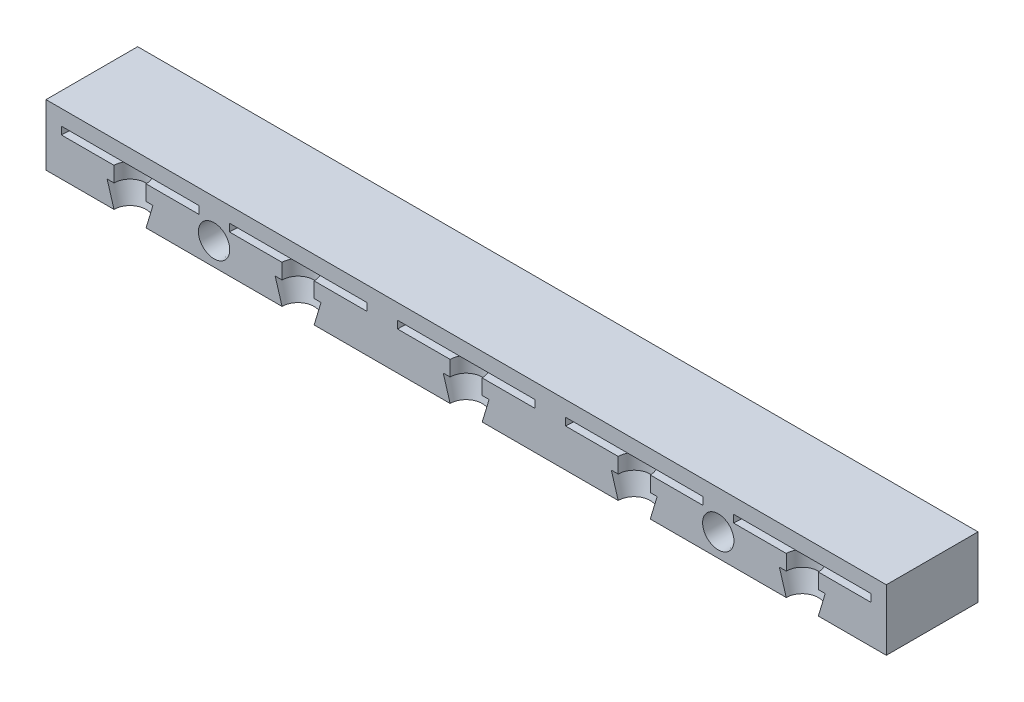
ISO-10303-21;
HEADER;
FILE_DESCRIPTION(('STEP AP214'),'2;1');
FILE_NAME('part.step','',(''),(''),'','','');
FILE_SCHEMA(('AUTOMOTIVE_DESIGN { 1 0 10303 214 1 1 1 1 }'));
ENDSEC;
DATA;
#1=APPLICATION_CONTEXT('core data for automotive mechanical design processes');
#2=APPLICATION_PROTOCOL_DEFINITION('international standard','automotive_design',2000,#1);
#3=PRODUCT_CONTEXT('',#1,'mechanical');
#4=PRODUCT('Part','Part','',(#3));
#5=PRODUCT_RELATED_PRODUCT_CATEGORY('part','',(#4));
#6=PRODUCT_DEFINITION_FORMATION('','',#4);
#7=PRODUCT_DEFINITION_CONTEXT('part definition',#1,'design');
#8=PRODUCT_DEFINITION('design','',#6,#7);
#9=PRODUCT_DEFINITION_SHAPE('','',#8);
#10=(LENGTH_UNIT() NAMED_UNIT(*) SI_UNIT(.MILLI.,.METRE.));
#11=(NAMED_UNIT(*) PLANE_ANGLE_UNIT() SI_UNIT($,.RADIAN.));
#12=(NAMED_UNIT(*) SI_UNIT($,.STERADIAN.) SOLID_ANGLE_UNIT());
#13=UNCERTAINTY_MEASURE_WITH_UNIT(LENGTH_MEASURE(1.E-05),#10,'distance_accuracy_value','');
#14=(GEOMETRIC_REPRESENTATION_CONTEXT(3) GLOBAL_UNCERTAINTY_ASSIGNED_CONTEXT((#13)) GLOBAL_UNIT_ASSIGNED_CONTEXT((#10,
#11,#12)) REPRESENTATION_CONTEXT('',''));
#15=CARTESIAN_POINT('',(0.,0.,0.));
#16=DIRECTION('',(0.,0.,1.));
#17=DIRECTION('',(1.,0.,0.));
#18=AXIS2_PLACEMENT_3D('',#15,#16,#17);
#19=CARTESIAN_POINT('',(0.,0.,-12.));
#20=DIRECTION('',(-1.,0.,0.));
#21=DIRECTION('',(0.,0.,1.));
#22=AXIS2_PLACEMENT_3D('',#19,#20,#21);
#23=PLANE('',#22);
#24=DIRECTION('',(0.,-1.,0.));
#25=VECTOR('',#24,1.);
#26=CARTESIAN_POINT('',(0.,0.,0.));
#27=LINE('',#26,#25);
#28=CARTESIAN_POINT('',(0.,8.,0.));
#29=VERTEX_POINT('',#28);
#30=CARTESIAN_POINT('',(0.,0.,0.));
#31=VERTEX_POINT('',#30);
#32=EDGE_CURVE('E376',#29,#31,#27,.T.);
#33=ORIENTED_EDGE('',*,*,#32,.F.);
#34=DIRECTION('',(0.,0.,1.));
#35=VECTOR('',#34,1.);
#36=CARTESIAN_POINT('',(0.,8.,-12.));
#37=LINE('',#36,#35);
#38=CARTESIAN_POINT('',(0.,8.,-12.));
#39=VERTEX_POINT('',#38);
#40=EDGE_CURVE('E403',#39,#29,#37,.T.);
#41=ORIENTED_EDGE('',*,*,#40,.F.);
#42=DIRECTION('',(0.,-1.,0.));
#43=VECTOR('',#42,1.);
#44=CARTESIAN_POINT('',(0.,0.,-12.));
#45=LINE('',#44,#43);
#46=CARTESIAN_POINT('',(0.,0.,-12.));
#47=VERTEX_POINT('',#46);
#48=EDGE_CURVE('E377',#39,#47,#45,.T.);
#49=ORIENTED_EDGE('',*,*,#48,.T.);
#50=DIRECTION('',(0.,0.,1.));
#51=VECTOR('',#50,1.);
#52=CARTESIAN_POINT('',(0.,0.,-12.));
#53=LINE('',#52,#51);
#54=EDGE_CURVE('E390',#47,#31,#53,.T.);
#55=ORIENTED_EDGE('',*,*,#54,.T.);
#56=EDGE_LOOP('',(#33,#41,#49,#55));
#57=FACE_BOUND('',#56,.T.);
#58=ADVANCED_FACE('F33',(#57),#23,.T.);
#59=CARTESIAN_POINT('',(0.,8.,-12.));
#60=DIRECTION('',(0.,1.,0.));
#61=DIRECTION('',(0.,0.,1.));
#62=AXIS2_PLACEMENT_3D('',#59,#60,#61);
#63=PLANE('',#62);
#64=DIRECTION('',(-1.,0.,0.));
#65=VECTOR('',#64,1.);
#66=CARTESIAN_POINT('',(0.,8.,0.));
#67=LINE('',#66,#65);
#68=CARTESIAN_POINT('',(110.,8.,0.));
#69=VERTEX_POINT('',#68);
#70=EDGE_CURVE('E381',#69,#29,#67,.T.);
#71=ORIENTED_EDGE('',*,*,#70,.F.);
#72=DIRECTION('',(0.,0.,1.));
#73=VECTOR('',#72,1.);
#74=CARTESIAN_POINT('',(110.,8.,-12.));
#75=LINE('',#74,#73);
#76=CARTESIAN_POINT('',(110.,8.,-12.));
#77=VERTEX_POINT('',#76);
#78=EDGE_CURVE('E406',#77,#69,#75,.T.);
#79=ORIENTED_EDGE('',*,*,#78,.F.);
#80=DIRECTION('',(-1.,0.,0.));
#81=VECTOR('',#80,1.);
#82=CARTESIAN_POINT('',(0.,8.,-12.));
#83=LINE('',#82,#81);
#84=EDGE_CURVE('E387',#77,#39,#83,.T.);
#85=ORIENTED_EDGE('',*,*,#84,.T.);
#86=ORIENTED_EDGE('',*,*,#40,.T.);
#87=EDGE_LOOP('',(#71,#79,#85,#86));
#88=FACE_BOUND('',#87,.T.);
#89=ADVANCED_FACE('F545',(#88),#63,.T.);
#90=CARTESIAN_POINT('',(110.,0.,-12.));
#91=DIRECTION('',(1.,0.,0.));
#92=DIRECTION('',(0.,0.,-1.));
#93=AXIS2_PLACEMENT_3D('',#90,#91,#92);
#94=PLANE('',#93);
#95=DIRECTION('',(0.,1.,0.));
#96=VECTOR('',#95,1.);
#97=CARTESIAN_POINT('',(110.,0.,0.));
#98=LINE('',#97,#96);
#99=CARTESIAN_POINT('',(110.,0.,0.));
#100=VERTEX_POINT('',#99);
#101=EDGE_CURVE('E397',#100,#69,#98,.T.);
#102=ORIENTED_EDGE('',*,*,#101,.F.);
#103=DIRECTION('',(0.,0.,1.));
#104=VECTOR('',#103,1.);
#105=CARTESIAN_POINT('',(110.,0.,-12.));
#106=LINE('',#105,#104);
#107=CARTESIAN_POINT('',(110.,0.,-12.));
#108=VERTEX_POINT('',#107);
#109=EDGE_CURVE('E408',#108,#100,#106,.T.);
#110=ORIENTED_EDGE('',*,*,#109,.F.);
#111=DIRECTION('',(0.,1.,0.));
#112=VECTOR('',#111,1.);
#113=CARTESIAN_POINT('',(110.,0.,-12.));
#114=LINE('',#113,#112);
#115=EDGE_CURVE('E384',#108,#77,#114,.T.);
#116=ORIENTED_EDGE('',*,*,#115,.T.);
#117=ORIENTED_EDGE('',*,*,#78,.T.);
#118=EDGE_LOOP('',(#102,#110,#116,#117));
#119=FACE_BOUND('',#118,.T.);
#120=ADVANCED_FACE('F542',(#119),#94,.T.);
#121=CARTESIAN_POINT('',(0.,0.,-12.));
#122=DIRECTION('',(0.,-1.,0.));
#123=DIRECTION('',(0.,0.,-1.));
#124=AXIS2_PLACEMENT_3D('',#121,#122,#123);
#125=PLANE('',#124);
#126=CARTESIAN_POINT('',(99.,0.,0.));
#127=DIRECTION('',(0.,1.,0.));
#128=DIRECTION('',(-1.,0.,0.));
#129=AXIS2_PLACEMENT_3D('',#126,#127,#128);
#130=CIRCLE('',#129,2.1);
#131=CARTESIAN_POINT('',(101.1,0.,0.));
#132=VERTEX_POINT('',#131);
#133=CARTESIAN_POINT('',(96.9,0.,0.));
#134=VERTEX_POINT('',#133);
#135=EDGE_CURVE('E299',#132,#134,#130,.T.);
#136=ORIENTED_EDGE('',*,*,#135,.T.);
#137=DIRECTION('',(1.,0.,0.));
#138=VECTOR('',#137,1.);
#139=CARTESIAN_POINT('',(0.,0.,0.));
#140=LINE('',#139,#138);
#141=CARTESIAN_POINT('',(79.1,0.,0.));
#142=VERTEX_POINT('',#141);
#143=EDGE_CURVE('E535',#142,#134,#140,.T.);
#144=ORIENTED_EDGE('',*,*,#143,.F.);
#145=CARTESIAN_POINT('',(77.,0.,0.));
#146=DIRECTION('',(0.,1.,0.));
#147=DIRECTION('',(-1.,0.,0.));
#148=AXIS2_PLACEMENT_3D('',#145,#146,#147);
#149=CIRCLE('',#148,2.1);
#150=CARTESIAN_POINT('',(74.9,0.,0.));
#151=VERTEX_POINT('',#150);
#152=EDGE_CURVE('E319',#142,#151,#149,.T.);
#153=ORIENTED_EDGE('',*,*,#152,.T.);
#154=CARTESIAN_POINT('',(57.1,0.,0.));
#155=VERTEX_POINT('',#154);
#156=EDGE_CURVE('E528',#155,#151,#140,.T.);
#157=ORIENTED_EDGE('',*,*,#156,.F.);
#158=CARTESIAN_POINT('',(55.,0.,0.));
#159=DIRECTION('',(0.,1.,0.));
#160=DIRECTION('',(-1.,0.,0.));
#161=AXIS2_PLACEMENT_3D('',#158,#159,#160);
#162=CIRCLE('',#161,2.1);
#163=CARTESIAN_POINT('',(52.9,0.,0.));
#164=VERTEX_POINT('',#163);
#165=EDGE_CURVE('E337',#155,#164,#162,.T.);
#166=ORIENTED_EDGE('',*,*,#165,.T.);
#167=CARTESIAN_POINT('',(35.1,0.,0.));
#168=VERTEX_POINT('',#167);
#169=EDGE_CURVE('E536',#168,#164,#140,.T.);
#170=ORIENTED_EDGE('',*,*,#169,.F.);
#171=CARTESIAN_POINT('',(33.,0.,0.));
#172=DIRECTION('',(0.,1.,0.));
#173=DIRECTION('',(-1.,0.,0.));
#174=AXIS2_PLACEMENT_3D('',#171,#172,#173);
#175=CIRCLE('',#174,2.1);
#176=CARTESIAN_POINT('',(30.9,0.,0.));
#177=VERTEX_POINT('',#176);
#178=EDGE_CURVE('E355',#168,#177,#175,.T.);
#179=ORIENTED_EDGE('',*,*,#178,.T.);
#180=CARTESIAN_POINT('',(13.1,0.,0.));
#181=VERTEX_POINT('',#180);
#182=EDGE_CURVE('E398',#181,#177,#140,.T.);
#183=ORIENTED_EDGE('',*,*,#182,.F.);
#184=CARTESIAN_POINT('',(11.,0.,0.));
#185=DIRECTION('',(0.,1.,0.));
#186=DIRECTION('',(-1.,0.,0.));
#187=AXIS2_PLACEMENT_3D('',#184,#185,#186);
#188=CIRCLE('',#187,2.1);
#189=CARTESIAN_POINT('',(8.9,0.,0.));
#190=VERTEX_POINT('',#189);
#191=EDGE_CURVE('E373',#181,#190,#188,.T.);
#192=ORIENTED_EDGE('',*,*,#191,.T.);
#193=EDGE_CURVE('E394',#31,#190,#140,.T.);
#194=ORIENTED_EDGE('',*,*,#193,.F.);
#195=ORIENTED_EDGE('',*,*,#54,.F.);
#196=DIRECTION('',(1.,0.,0.));
#197=VECTOR('',#196,1.);
#198=CARTESIAN_POINT('',(0.,0.,-12.));
#199=LINE('',#198,#197);
#200=EDGE_CURVE('E380',#47,#108,#199,.T.);
#201=ORIENTED_EDGE('',*,*,#200,.T.);
#202=ORIENTED_EDGE('',*,*,#109,.T.);
#203=EDGE_CURVE('E393',#132,#100,#140,.T.);
#204=ORIENTED_EDGE('',*,*,#203,.F.);
#205=EDGE_LOOP('',(#136,#144,#153,#157,#166,#170,#179,#183,#192,#194,#195,#201,#202,#204));
#206=FACE_BOUND('',#205,.T.);
#207=ADVANCED_FACE('F534',(#206),#125,.T.);
#208=CARTESIAN_POINT('',(0.,0.,-12.));
#209=DIRECTION('',(0.,0.,-1.));
#210=DIRECTION('',(-1.,0.,0.));
#211=AXIS2_PLACEMENT_3D('',#208,#209,#210);
#212=PLANE('',#211);
#213=ORIENTED_EDGE('',*,*,#48,.F.);
#214=ORIENTED_EDGE('',*,*,#84,.F.);
#215=ORIENTED_EDGE('',*,*,#115,.F.);
#216=ORIENTED_EDGE('',*,*,#200,.F.);
#217=EDGE_LOOP('',(#213,#214,#215,#216));
#218=FACE_BOUND('',#217,.T.);
#219=ADVANCED_FACE('F594',(#218),#212,.T.);
#220=CARTESIAN_POINT('',(0.,0.,0.));
#221=DIRECTION('',(0.,0.,-1.));
#222=DIRECTION('',(-1.,0.,0.));
#223=AXIS2_PLACEMENT_3D('',#220,#221,#222);
#224=PLANE('',#223);
#225=CARTESIAN_POINT('',(22.,3.,0.));
#226=DIRECTION('',(0.,0.,1.));
#227=DIRECTION('',(1.,0.,0.));
#228=AXIS2_PLACEMENT_3D('',#225,#226,#227);
#229=CIRCLE('',#228,2.05);
#230=CARTESIAN_POINT('',(24.05,3.,0.));
#231=VERTEX_POINT('',#230);
#232=EDGE_CURVE('E906',#231,#231,#229,.T.);
#233=ORIENTED_EDGE('',*,*,#232,.F.);
#234=EDGE_LOOP('',(#233));
#235=FACE_BOUND('',#234,.T.);
#236=CARTESIAN_POINT('',(88.,3.,0.));
#237=DIRECTION('',(0.,0.,1.));
#238=DIRECTION('',(1.,0.,0.));
#239=AXIS2_PLACEMENT_3D('',#236,#237,#238);
#240=CIRCLE('',#239,2.04999999999999);
#241=CARTESIAN_POINT('',(90.05,3.,0.));
#242=VERTEX_POINT('',#241);
#243=EDGE_CURVE('E912',#242,#242,#240,.T.);
#244=ORIENTED_EDGE('',*,*,#243,.F.);
#245=EDGE_LOOP('',(#244));
#246=FACE_BOUND('',#245,.T.);
#247=ORIENTED_EDGE('',*,*,#143,.T.);
#248=DIRECTION('',(-0.287347885566346,0.957826285221151,0.));
#249=VECTOR('',#248,1.);
#250=CARTESIAN_POINT('',(99.,-7.,0.));
#251=LINE('',#250,#249);
#252=CARTESIAN_POINT('',(96.,3.,0.));
#253=VERTEX_POINT('',#252);
#254=EDGE_CURVE('E11',#134,#253,#251,.T.);
#255=ORIENTED_EDGE('',*,*,#254,.T.);
#256=DIRECTION('',(1.,0.,0.));
#257=VECTOR('',#256,1.);
#258=CARTESIAN_POINT('',(0.,2.99999999999998,0.));
#259=LINE('',#258,#257);
#260=CARTESIAN_POINT('',(96.9,3.,0.));
#261=VERTEX_POINT('',#260);
#262=EDGE_CURVE('E284',#253,#261,#259,.T.);
#263=ORIENTED_EDGE('',*,*,#262,.T.);
#264=DIRECTION('',(0.,1.,0.));
#265=VECTOR('',#264,1.);
#266=CARTESIAN_POINT('',(96.9,6.,0.));
#267=LINE('',#266,#265);
#268=CARTESIAN_POINT('',(96.9,5.,0.));
#269=VERTEX_POINT('',#268);
#270=EDGE_CURVE('E280',#261,#269,#267,.T.);
#271=ORIENTED_EDGE('',*,*,#270,.T.);
#272=DIRECTION('',(-1.,0.,0.));
#273=VECTOR('',#272,1.);
#274=CARTESIAN_POINT('',(0.,4.99999999999998,0.));
#275=LINE('',#274,#273);
#276=CARTESIAN_POINT('',(90.,5.,0.));
#277=VERTEX_POINT('',#276);
#278=EDGE_CURVE('E271',#269,#277,#275,.T.);
#279=ORIENTED_EDGE('',*,*,#278,.T.);
#280=DIRECTION('',(0.,1.,0.));
#281=VECTOR('',#280,1.);
#282=CARTESIAN_POINT('',(90.,6.,0.));
#283=LINE('',#282,#281);
#284=CARTESIAN_POINT('',(90.,6.,0.));
#285=VERTEX_POINT('',#284);
#286=EDGE_CURVE('E262',#277,#285,#283,.T.);
#287=ORIENTED_EDGE('',*,*,#286,.T.);
#288=DIRECTION('',(1.,0.,0.));
#289=VECTOR('',#288,1.);
#290=CARTESIAN_POINT('',(0.,5.99999999999997,0.));
#291=LINE('',#290,#289);
#292=CARTESIAN_POINT('',(108.,6.,0.));
#293=VERTEX_POINT('',#292);
#294=EDGE_CURVE('E251',#285,#293,#291,.T.);
#295=ORIENTED_EDGE('',*,*,#294,.T.);
#296=DIRECTION('',(0.,1.,0.));
#297=VECTOR('',#296,1.);
#298=CARTESIAN_POINT('',(108.,6.,0.));
#299=LINE('',#298,#297);
#300=CARTESIAN_POINT('',(108.,5.00000000000001,0.));
#301=VERTEX_POINT('',#300);
#302=EDGE_CURVE('E256',#293,#301,#299,.F.);
#303=ORIENTED_EDGE('',*,*,#302,.T.);
#304=CARTESIAN_POINT('',(101.1,5.,0.));
#305=VERTEX_POINT('',#304);
#306=EDGE_CURVE('E273',#301,#305,#275,.T.);
#307=ORIENTED_EDGE('',*,*,#306,.T.);
#308=DIRECTION('',(0.,1.,0.));
#309=VECTOR('',#308,1.);
#310=CARTESIAN_POINT('',(101.1,6.,0.));
#311=LINE('',#310,#309);
#312=CARTESIAN_POINT('',(101.1,3.,0.));
#313=VERTEX_POINT('',#312);
#314=EDGE_CURVE('E277',#305,#313,#311,.F.);
#315=ORIENTED_EDGE('',*,*,#314,.T.);
#316=CARTESIAN_POINT('',(102.,3.,0.));
#317=VERTEX_POINT('',#316);
#318=EDGE_CURVE('E282',#313,#317,#259,.T.);
#319=ORIENTED_EDGE('',*,*,#318,.T.);
#320=DIRECTION('',(-0.287347885566345,-0.957826285221152,0.));
#321=VECTOR('',#320,1.);
#322=CARTESIAN_POINT('',(99.,-7.,0.));
#323=LINE('',#322,#321);
#324=EDGE_CURVE('E40',#317,#132,#323,.T.);
#325=ORIENTED_EDGE('',*,*,#324,.T.);
#326=ORIENTED_EDGE('',*,*,#203,.T.);
#327=ORIENTED_EDGE('',*,*,#101,.T.);
#328=ORIENTED_EDGE('',*,*,#70,.T.);
#329=ORIENTED_EDGE('',*,*,#32,.T.);
#330=ORIENTED_EDGE('',*,*,#193,.T.);
#331=DIRECTION('',(-0.287347885566346,0.957826285221151,0.));
#332=VECTOR('',#331,1.);
#333=CARTESIAN_POINT('',(11.,-7.,0.));
#334=LINE('',#333,#332);
#335=CARTESIAN_POINT('',(8.,3.,0.));
#336=VERTEX_POINT('',#335);
#337=EDGE_CURVE('E437',#190,#336,#334,.T.);
#338=ORIENTED_EDGE('',*,*,#337,.T.);
#339=DIRECTION('',(1.,0.,0.));
#340=VECTOR('',#339,1.);
#341=CARTESIAN_POINT('',(0.,3.,0.));
#342=LINE('',#341,#340);
#343=CARTESIAN_POINT('',(8.9,3.,0.));
#344=VERTEX_POINT('',#343);
#345=EDGE_CURVE('E433',#336,#344,#342,.T.);
#346=ORIENTED_EDGE('',*,*,#345,.T.);
#347=DIRECTION('',(0.,1.,0.));
#348=VECTOR('',#347,1.);
#349=CARTESIAN_POINT('',(8.9,6.,0.));
#350=LINE('',#349,#348);
#351=CARTESIAN_POINT('',(8.9,5.,0.));
#352=VERTEX_POINT('',#351);
#353=EDGE_CURVE('E427',#344,#352,#350,.T.);
#354=ORIENTED_EDGE('',*,*,#353,.T.);
#355=DIRECTION('',(-1.,0.,0.));
#356=VECTOR('',#355,1.);
#357=CARTESIAN_POINT('',(0.,5.,0.));
#358=LINE('',#357,#356);
#359=CARTESIAN_POINT('',(1.99999999999999,5.,0.));
#360=VERTEX_POINT('',#359);
#361=EDGE_CURVE('E420',#352,#360,#358,.T.);
#362=ORIENTED_EDGE('',*,*,#361,.T.);
#363=DIRECTION('',(0.,1.,0.));
#364=VECTOR('',#363,1.);
#365=CARTESIAN_POINT('',(1.99999999999999,6.,0.));
#366=LINE('',#365,#364);
#367=CARTESIAN_POINT('',(1.99999999999999,6.,0.));
#368=VERTEX_POINT('',#367);
#369=EDGE_CURVE('E417',#360,#368,#366,.T.);
#370=ORIENTED_EDGE('',*,*,#369,.T.);
#371=DIRECTION('',(1.,0.,0.));
#372=VECTOR('',#371,1.);
#373=CARTESIAN_POINT('',(0.,6.,0.));
#374=LINE('',#373,#372);
#375=CARTESIAN_POINT('',(20.,6.,0.));
#376=VERTEX_POINT('',#375);
#377=EDGE_CURVE('E405',#368,#376,#374,.T.);
#378=ORIENTED_EDGE('',*,*,#377,.T.);
#379=DIRECTION('',(0.,1.,0.));
#380=VECTOR('',#379,1.);
#381=CARTESIAN_POINT('',(20.,6.,0.));
#382=LINE('',#381,#380);
#383=CARTESIAN_POINT('',(20.,5.,0.));
#384=VERTEX_POINT('',#383);
#385=EDGE_CURVE('E414',#376,#384,#382,.F.);
#386=ORIENTED_EDGE('',*,*,#385,.T.);
#387=CARTESIAN_POINT('',(13.1,5.,0.));
#388=VERTEX_POINT('',#387);
#389=EDGE_CURVE('E423',#384,#388,#358,.T.);
#390=ORIENTED_EDGE('',*,*,#389,.T.);
#391=DIRECTION('',(0.,1.,0.));
#392=VECTOR('',#391,1.);
#393=CARTESIAN_POINT('',(13.1,6.,0.));
#394=LINE('',#393,#392);
#395=CARTESIAN_POINT('',(13.1,3.,0.));
#396=VERTEX_POINT('',#395);
#397=EDGE_CURVE('E424',#388,#396,#394,.F.);
#398=ORIENTED_EDGE('',*,*,#397,.T.);
#399=CARTESIAN_POINT('',(14.,3.,0.));
#400=VERTEX_POINT('',#399);
#401=EDGE_CURVE('E430',#396,#400,#342,.T.);
#402=ORIENTED_EDGE('',*,*,#401,.T.);
#403=DIRECTION('',(-0.287347885566345,-0.957826285221152,0.));
#404=VECTOR('',#403,1.);
#405=CARTESIAN_POINT('',(11.,-7.,0.));
#406=LINE('',#405,#404);
#407=EDGE_CURVE('E434',#400,#181,#406,.T.);
#408=ORIENTED_EDGE('',*,*,#407,.T.);
#409=ORIENTED_EDGE('',*,*,#182,.T.);
#410=DIRECTION('',(-0.287347885566346,0.957826285221151,0.));
#411=VECTOR('',#410,1.);
#412=CARTESIAN_POINT('',(33.,-7.,0.));
#413=LINE('',#412,#411);
#414=CARTESIAN_POINT('',(30.,3.,0.));
#415=VERTEX_POINT('',#414);
#416=EDGE_CURVE('E466',#177,#415,#413,.T.);
#417=ORIENTED_EDGE('',*,*,#416,.T.);
#418=DIRECTION('',(1.,0.,0.));
#419=VECTOR('',#418,1.);
#420=CARTESIAN_POINT('',(0.,2.99999999999999,0.));
#421=LINE('',#420,#419);
#422=CARTESIAN_POINT('',(30.9,3.,0.));
#423=VERTEX_POINT('',#422);
#424=EDGE_CURVE('E462',#415,#423,#421,.T.);
#425=ORIENTED_EDGE('',*,*,#424,.T.);
#426=DIRECTION('',(0.,1.,0.));
#427=VECTOR('',#426,1.);
#428=CARTESIAN_POINT('',(30.9,6.,0.));
#429=LINE('',#428,#427);
#430=CARTESIAN_POINT('',(30.9,5.,0.));
#431=VERTEX_POINT('',#430);
#432=EDGE_CURVE('E456',#423,#431,#429,.T.);
#433=ORIENTED_EDGE('',*,*,#432,.T.);
#434=DIRECTION('',(-1.,0.,0.));
#435=VECTOR('',#434,1.);
#436=CARTESIAN_POINT('',(0.,4.99999999999999,0.));
#437=LINE('',#436,#435);
#438=CARTESIAN_POINT('',(24.,5.,0.));
#439=VERTEX_POINT('',#438);
#440=EDGE_CURVE('E449',#431,#439,#437,.T.);
#441=ORIENTED_EDGE('',*,*,#440,.T.);
#442=DIRECTION('',(0.,1.,0.));
#443=VECTOR('',#442,1.);
#444=CARTESIAN_POINT('',(24.,6.,0.));
#445=LINE('',#444,#443);
#446=CARTESIAN_POINT('',(24.,6.,0.));
#447=VERTEX_POINT('',#446);
#448=EDGE_CURVE('E446',#439,#447,#445,.T.);
#449=ORIENTED_EDGE('',*,*,#448,.T.);
#450=DIRECTION('',(1.,0.,0.));
#451=VECTOR('',#450,1.);
#452=CARTESIAN_POINT('',(0.,5.99999999999999,0.));
#453=LINE('',#452,#451);
#454=CARTESIAN_POINT('',(42.,6.,0.));
#455=VERTEX_POINT('',#454);
#456=EDGE_CURVE('E440',#447,#455,#453,.T.);
#457=ORIENTED_EDGE('',*,*,#456,.T.);
#458=DIRECTION('',(0.,1.,0.));
#459=VECTOR('',#458,1.);
#460=CARTESIAN_POINT('',(42.,6.,0.));
#461=LINE('',#460,#459);
#462=CARTESIAN_POINT('',(42.,5.,0.));
#463=VERTEX_POINT('',#462);
#464=EDGE_CURVE('E443',#455,#463,#461,.F.);
#465=ORIENTED_EDGE('',*,*,#464,.T.);
#466=CARTESIAN_POINT('',(35.1,5.,0.));
#467=VERTEX_POINT('',#466);
#468=EDGE_CURVE('E452',#463,#467,#437,.T.);
#469=ORIENTED_EDGE('',*,*,#468,.T.);
#470=DIRECTION('',(0.,1.,0.));
#471=VECTOR('',#470,1.);
#472=CARTESIAN_POINT('',(35.1,6.,0.));
#473=LINE('',#472,#471);
#474=CARTESIAN_POINT('',(35.1,3.,0.));
#475=VERTEX_POINT('',#474);
#476=EDGE_CURVE('E453',#467,#475,#473,.F.);
#477=ORIENTED_EDGE('',*,*,#476,.T.);
#478=CARTESIAN_POINT('',(36.,3.,0.));
#479=VERTEX_POINT('',#478);
#480=EDGE_CURVE('E459',#475,#479,#421,.T.);
#481=ORIENTED_EDGE('',*,*,#480,.T.);
#482=DIRECTION('',(-0.287347885566345,-0.957826285221152,0.));
#483=VECTOR('',#482,1.);
#484=CARTESIAN_POINT('',(33.,-7.,0.));
#485=LINE('',#484,#483);
#486=EDGE_CURVE('E463',#479,#168,#485,.T.);
#487=ORIENTED_EDGE('',*,*,#486,.T.);
#488=ORIENTED_EDGE('',*,*,#169,.T.);
#489=DIRECTION('',(-0.287347885566346,0.957826285221151,0.));
#490=VECTOR('',#489,1.);
#491=CARTESIAN_POINT('',(55.,-7.,0.));
#492=LINE('',#491,#490);
#493=CARTESIAN_POINT('',(52.,3.,0.));
#494=VERTEX_POINT('',#493);
#495=EDGE_CURVE('E495',#164,#494,#492,.T.);
#496=ORIENTED_EDGE('',*,*,#495,.T.);
#497=DIRECTION('',(1.,0.,0.));
#498=VECTOR('',#497,1.);
#499=CARTESIAN_POINT('',(0.,2.99999999999999,0.));
#500=LINE('',#499,#498);
#501=CARTESIAN_POINT('',(52.9,3.,0.));
#502=VERTEX_POINT('',#501);
#503=EDGE_CURVE('E491',#494,#502,#500,.T.);
#504=ORIENTED_EDGE('',*,*,#503,.T.);
#505=DIRECTION('',(0.,1.,0.));
#506=VECTOR('',#505,1.);
#507=CARTESIAN_POINT('',(52.9,6.,0.));
#508=LINE('',#507,#506);
#509=CARTESIAN_POINT('',(52.9,5.,0.));
#510=VERTEX_POINT('',#509);
#511=EDGE_CURVE('E485',#502,#510,#508,.T.);
#512=ORIENTED_EDGE('',*,*,#511,.T.);
#513=DIRECTION('',(-1.,0.,0.));
#514=VECTOR('',#513,1.);
#515=CARTESIAN_POINT('',(0.,4.99999999999999,0.));
#516=LINE('',#515,#514);
#517=CARTESIAN_POINT('',(46.,5.,0.));
#518=VERTEX_POINT('',#517);
#519=EDGE_CURVE('E478',#510,#518,#516,.T.);
#520=ORIENTED_EDGE('',*,*,#519,.T.);
#521=DIRECTION('',(0.,1.,0.));
#522=VECTOR('',#521,1.);
#523=CARTESIAN_POINT('',(46.,6.,0.));
#524=LINE('',#523,#522);
#525=CARTESIAN_POINT('',(46.,6.,0.));
#526=VERTEX_POINT('',#525);
#527=EDGE_CURVE('E475',#518,#526,#524,.T.);
#528=ORIENTED_EDGE('',*,*,#527,.T.);
#529=DIRECTION('',(1.,0.,0.));
#530=VECTOR('',#529,1.);
#531=CARTESIAN_POINT('',(0.,5.99999999999998,0.));
#532=LINE('',#531,#530);
#533=CARTESIAN_POINT('',(64.,6.,0.));
#534=VERTEX_POINT('',#533);
#535=EDGE_CURVE('E469',#526,#534,#532,.T.);
#536=ORIENTED_EDGE('',*,*,#535,.T.);
#537=DIRECTION('',(0.,1.,0.));
#538=VECTOR('',#537,1.);
#539=CARTESIAN_POINT('',(64.,6.,0.));
#540=LINE('',#539,#538);
#541=CARTESIAN_POINT('',(64.,5.,0.));
#542=VERTEX_POINT('',#541);
#543=EDGE_CURVE('E472',#534,#542,#540,.F.);
#544=ORIENTED_EDGE('',*,*,#543,.T.);
#545=CARTESIAN_POINT('',(57.1,5.,0.));
#546=VERTEX_POINT('',#545);
#547=EDGE_CURVE('E481',#542,#546,#516,.T.);
#548=ORIENTED_EDGE('',*,*,#547,.T.);
#549=DIRECTION('',(0.,1.,0.));
#550=VECTOR('',#549,1.);
#551=CARTESIAN_POINT('',(57.1,6.,0.));
#552=LINE('',#551,#550);
#553=CARTESIAN_POINT('',(57.1,3.,0.));
#554=VERTEX_POINT('',#553);
#555=EDGE_CURVE('E482',#546,#554,#552,.F.);
#556=ORIENTED_EDGE('',*,*,#555,.T.);
#557=CARTESIAN_POINT('',(58.,3.,0.));
#558=VERTEX_POINT('',#557);
#559=EDGE_CURVE('E488',#554,#558,#500,.T.);
#560=ORIENTED_EDGE('',*,*,#559,.T.);
#561=DIRECTION('',(-0.287347885566345,-0.957826285221152,0.));
#562=VECTOR('',#561,1.);
#563=CARTESIAN_POINT('',(55.,-7.,0.));
#564=LINE('',#563,#562);
#565=EDGE_CURVE('E492',#558,#155,#564,.T.);
#566=ORIENTED_EDGE('',*,*,#565,.T.);
#567=ORIENTED_EDGE('',*,*,#156,.T.);
#568=DIRECTION('',(-0.287347885566346,0.957826285221151,0.));
#569=VECTOR('',#568,1.);
#570=CARTESIAN_POINT('',(77.,-7.,0.));
#571=LINE('',#570,#569);
#572=CARTESIAN_POINT('',(74.,3.,0.));
#573=VERTEX_POINT('',#572);
#574=EDGE_CURVE('E257',#151,#573,#571,.T.);
#575=ORIENTED_EDGE('',*,*,#574,.T.);
#576=DIRECTION('',(1.,0.,0.));
#577=VECTOR('',#576,1.);
#578=CARTESIAN_POINT('',(0.,2.99999999999998,0.));
#579=LINE('',#578,#577);
#580=CARTESIAN_POINT('',(74.9,3.,0.));
#581=VERTEX_POINT('',#580);
#582=EDGE_CURVE('E520',#573,#581,#579,.T.);
#583=ORIENTED_EDGE('',*,*,#582,.T.);
#584=DIRECTION('',(0.,1.,0.));
#585=VECTOR('',#584,1.);
#586=CARTESIAN_POINT('',(74.9,6.,0.));
#587=LINE('',#586,#585);
#588=CARTESIAN_POINT('',(74.9,5.,0.));
#589=VERTEX_POINT('',#588);
#590=EDGE_CURVE('E514',#581,#589,#587,.T.);
#591=ORIENTED_EDGE('',*,*,#590,.T.);
#592=DIRECTION('',(-1.,0.,0.));
#593=VECTOR('',#592,1.);
#594=CARTESIAN_POINT('',(0.,4.99999999999998,0.));
#595=LINE('',#594,#593);
#596=CARTESIAN_POINT('',(68.,5.,0.));
#597=VERTEX_POINT('',#596);
#598=EDGE_CURVE('E507',#589,#597,#595,.T.);
#599=ORIENTED_EDGE('',*,*,#598,.T.);
#600=DIRECTION('',(0.,1.,0.));
#601=VECTOR('',#600,1.);
#602=CARTESIAN_POINT('',(68.,6.,0.));
#603=LINE('',#602,#601);
#604=CARTESIAN_POINT('',(68.,6.,0.));
#605=VERTEX_POINT('',#604);
#606=EDGE_CURVE('E504',#597,#605,#603,.T.);
#607=ORIENTED_EDGE('',*,*,#606,.T.);
#608=DIRECTION('',(1.,0.,0.));
#609=VECTOR('',#608,1.);
#610=CARTESIAN_POINT('',(0.,5.99999999999998,0.));
#611=LINE('',#610,#609);
#612=CARTESIAN_POINT('',(86.,6.,0.));
#613=VERTEX_POINT('',#612);
#614=EDGE_CURVE('E498',#605,#613,#611,.T.);
#615=ORIENTED_EDGE('',*,*,#614,.T.);
#616=DIRECTION('',(0.,1.,0.));
#617=VECTOR('',#616,1.);
#618=CARTESIAN_POINT('',(86.,6.,0.));
#619=LINE('',#618,#617);
#620=CARTESIAN_POINT('',(86.,5.,0.));
#621=VERTEX_POINT('',#620);
#622=EDGE_CURVE('E501',#613,#621,#619,.F.);
#623=ORIENTED_EDGE('',*,*,#622,.T.);
#624=CARTESIAN_POINT('',(79.1,5.,0.));
#625=VERTEX_POINT('',#624);
#626=EDGE_CURVE('E510',#621,#625,#595,.T.);
#627=ORIENTED_EDGE('',*,*,#626,.T.);
#628=DIRECTION('',(0.,1.,0.));
#629=VECTOR('',#628,1.);
#630=CARTESIAN_POINT('',(79.1,6.,0.));
#631=LINE('',#630,#629);
#632=CARTESIAN_POINT('',(79.1,3.,0.));
#633=VERTEX_POINT('',#632);
#634=EDGE_CURVE('E511',#625,#633,#631,.F.);
#635=ORIENTED_EDGE('',*,*,#634,.T.);
#636=CARTESIAN_POINT('',(80.,3.,0.));
#637=VERTEX_POINT('',#636);
#638=EDGE_CURVE('E517',#633,#637,#579,.T.);
#639=ORIENTED_EDGE('',*,*,#638,.T.);
#640=DIRECTION('',(-0.287347885566345,-0.957826285221152,0.));
#641=VECTOR('',#640,1.);
#642=CARTESIAN_POINT('',(77.,-7.,0.));
#643=LINE('',#642,#641);
#644=EDGE_CURVE('E521',#637,#142,#643,.T.);
#645=ORIENTED_EDGE('',*,*,#644,.T.);
#646=EDGE_LOOP('',(#247,#255,#263,#271,#279,#287,#295,#303,#307,#315,#319,#325,#326,#327,#328,
#329,#330,#338,#346,#354,#362,#370,#378,#386,#390,#398,#402,#408,#409,#417,#425,#433,#441,#449,
#457,#465,#469,#477,#481,#487,#488,#496,#504,#512,#520,#528,#536,#544,#548,#556,#560,#566,#567,
#575,#583,#591,#599,#607,#615,#623,#627,#635,#639,#645));
#647=FACE_BOUND('',#646,.T.);
#648=ADVANCED_FACE('F269',(#235,#246,#647),#224,.F.);
#649=CARTESIAN_POINT('',(11.,3.,0.));
#650=DIRECTION('',(0.,1.,0.));
#651=DIRECTION('',(-1.,0.,0.));
#652=AXIS2_PLACEMENT_3D('',#649,#650,#651);
#653=CONICAL_SURFACE('',#652,3.,0.291456794477867);
#654=ORIENTED_EDGE('',*,*,#191,.F.);
#655=ORIENTED_EDGE('',*,*,#407,.F.);
#656=CARTESIAN_POINT('',(11.,3.,0.));
#657=DIRECTION('',(0.,1.,0.));
#658=DIRECTION('',(-1.,0.,0.));
#659=AXIS2_PLACEMENT_3D('',#656,#657,#658);
#660=CIRCLE('',#659,3.);
#661=EDGE_CURVE('E370',#400,#336,#660,.T.);
#662=ORIENTED_EDGE('',*,*,#661,.T.);
#663=ORIENTED_EDGE('',*,*,#337,.F.);
#664=EDGE_LOOP('',(#654,#655,#662,#663));
#665=FACE_BOUND('',#664,.T.);
#666=ADVANCED_FACE('F553',(#665),#653,.F.);
#667=CARTESIAN_POINT('',(8.,3.,0.));
#668=DIRECTION('',(0.,1.,0.));
#669=DIRECTION('',(-1.,0.,0.));
#670=AXIS2_PLACEMENT_3D('',#667,#668,#669);
#671=PLANE('',#670);
#672=ORIENTED_EDGE('',*,*,#661,.F.);
#673=ORIENTED_EDGE('',*,*,#401,.F.);
#674=CARTESIAN_POINT('',(11.,3.,0.));
#675=DIRECTION('',(0.,1.,0.));
#676=DIRECTION('',(-1.,0.,0.));
#677=AXIS2_PLACEMENT_3D('',#674,#675,#676);
#678=CIRCLE('',#677,2.1);
#679=EDGE_CURVE('E367',#396,#344,#678,.T.);
#680=ORIENTED_EDGE('',*,*,#679,.T.);
#681=ORIENTED_EDGE('',*,*,#345,.F.);
#682=EDGE_LOOP('',(#672,#673,#680,#681));
#683=FACE_BOUND('',#682,.T.);
#684=ADVANCED_FACE('F558',(#683),#671,.F.);
#685=CARTESIAN_POINT('',(11.,6.,0.));
#686=DIRECTION('',(0.,1.,0.));
#687=DIRECTION('',(-1.,0.,0.));
#688=AXIS2_PLACEMENT_3D('',#685,#686,#687);
#689=CYLINDRICAL_SURFACE('',#688,2.1);
#690=ORIENTED_EDGE('',*,*,#679,.F.);
#691=ORIENTED_EDGE('',*,*,#397,.F.);
#692=CARTESIAN_POINT('',(11.,5.,0.));
#693=DIRECTION('',(0.,1.,0.));
#694=DIRECTION('',(-1.,0.,0.));
#695=AXIS2_PLACEMENT_3D('',#692,#693,#694);
#696=CIRCLE('',#695,2.1);
#697=EDGE_CURVE('E364',#388,#352,#696,.T.);
#698=ORIENTED_EDGE('',*,*,#697,.T.);
#699=ORIENTED_EDGE('',*,*,#353,.F.);
#700=EDGE_LOOP('',(#690,#691,#698,#699));
#701=FACE_BOUND('',#700,.T.);
#702=ADVANCED_FACE('F561',(#701),#689,.F.);
#703=CARTESIAN_POINT('',(8.9,5.,0.));
#704=DIRECTION('',(0.,-1.,0.));
#705=DIRECTION('',(1.,0.,0.));
#706=AXIS2_PLACEMENT_3D('',#703,#704,#705);
#707=PLANE('',#706);
#708=CARTESIAN_POINT('',(11.,5.,0.));
#709=DIRECTION('',(0.,1.,0.));
#710=DIRECTION('',(-1.,0.,0.));
#711=AXIS2_PLACEMENT_3D('',#708,#709,#710);
#712=CIRCLE('',#711,9.00000000000001);
#713=EDGE_CURVE('E361',#384,#360,#712,.T.);
#714=ORIENTED_EDGE('',*,*,#713,.T.);
#715=ORIENTED_EDGE('',*,*,#361,.F.);
#716=ORIENTED_EDGE('',*,*,#697,.F.);
#717=ORIENTED_EDGE('',*,*,#389,.F.);
#718=EDGE_LOOP('',(#714,#715,#716,#717));
#719=FACE_BOUND('',#718,.T.);
#720=ADVANCED_FACE('F564',(#719),#707,.F.);
#721=CARTESIAN_POINT('',(11.,6.,0.));
#722=DIRECTION('',(0.,1.,0.));
#723=DIRECTION('',(-1.,0.,0.));
#724=AXIS2_PLACEMENT_3D('',#721,#722,#723);
#725=CYLINDRICAL_SURFACE('',#724,9.00000000000001);
#726=ORIENTED_EDGE('',*,*,#713,.F.);
#727=ORIENTED_EDGE('',*,*,#385,.F.);
#728=CARTESIAN_POINT('',(11.,6.,0.));
#729=DIRECTION('',(0.,1.,0.));
#730=DIRECTION('',(-1.,0.,0.));
#731=AXIS2_PLACEMENT_3D('',#728,#729,#730);
#732=CIRCLE('',#731,9.00000000000001);
#733=EDGE_CURVE('E358',#376,#368,#732,.T.);
#734=ORIENTED_EDGE('',*,*,#733,.T.);
#735=ORIENTED_EDGE('',*,*,#369,.F.);
#736=EDGE_LOOP('',(#726,#727,#734,#735));
#737=FACE_BOUND('',#736,.T.);
#738=ADVANCED_FACE('F568',(#737),#725,.F.);
#739=CARTESIAN_POINT('',(1.99999999999999,6.,0.));
#740=DIRECTION('',(0.,1.,0.));
#741=DIRECTION('',(-1.,0.,0.));
#742=AXIS2_PLACEMENT_3D('',#739,#740,#741);
#743=PLANE('',#742);
#744=ORIENTED_EDGE('',*,*,#733,.F.);
#745=ORIENTED_EDGE('',*,*,#377,.F.);
#746=EDGE_LOOP('',(#744,#745));
#747=FACE_BOUND('',#746,.T.);
#748=ADVANCED_FACE('F570',(#747),#743,.F.);
#749=CARTESIAN_POINT('',(33.,3.,0.));
#750=DIRECTION('',(0.,1.,0.));
#751=DIRECTION('',(-1.,0.,0.));
#752=AXIS2_PLACEMENT_3D('',#749,#750,#751);
#753=CONICAL_SURFACE('',#752,3.,0.291456794477867);
#754=ORIENTED_EDGE('',*,*,#178,.F.);
#755=ORIENTED_EDGE('',*,*,#486,.F.);
#756=CARTESIAN_POINT('',(33.,3.,0.));
#757=DIRECTION('',(0.,1.,0.));
#758=DIRECTION('',(-1.,0.,0.));
#759=AXIS2_PLACEMENT_3D('',#756,#757,#758);
#760=CIRCLE('',#759,3.);
#761=EDGE_CURVE('E352',#479,#415,#760,.T.);
#762=ORIENTED_EDGE('',*,*,#761,.T.);
#763=ORIENTED_EDGE('',*,*,#416,.F.);
#764=EDGE_LOOP('',(#754,#755,#762,#763));
#765=FACE_BOUND('',#764,.T.);
#766=ADVANCED_FACE('F572',(#765),#753,.F.);
#767=CARTESIAN_POINT('',(30.,3.,0.));
#768=DIRECTION('',(0.,1.,0.));
#769=DIRECTION('',(-1.,0.,0.));
#770=AXIS2_PLACEMENT_3D('',#767,#768,#769);
#771=PLANE('',#770);
#772=ORIENTED_EDGE('',*,*,#761,.F.);
#773=ORIENTED_EDGE('',*,*,#480,.F.);
#774=CARTESIAN_POINT('',(33.,3.,0.));
#775=DIRECTION('',(0.,1.,0.));
#776=DIRECTION('',(-1.,0.,0.));
#777=AXIS2_PLACEMENT_3D('',#774,#775,#776);
#778=CIRCLE('',#777,2.1);
#779=EDGE_CURVE('E349',#475,#423,#778,.T.);
#780=ORIENTED_EDGE('',*,*,#779,.T.);
#781=ORIENTED_EDGE('',*,*,#424,.F.);
#782=EDGE_LOOP('',(#772,#773,#780,#781));
#783=FACE_BOUND('',#782,.T.);
#784=ADVANCED_FACE('F578',(#783),#771,.F.);
#785=CARTESIAN_POINT('',(33.,6.,0.));
#786=DIRECTION('',(0.,1.,0.));
#787=DIRECTION('',(-1.,0.,0.));
#788=AXIS2_PLACEMENT_3D('',#785,#786,#787);
#789=CYLINDRICAL_SURFACE('',#788,2.1);
#790=ORIENTED_EDGE('',*,*,#779,.F.);
#791=ORIENTED_EDGE('',*,*,#476,.F.);
#792=CARTESIAN_POINT('',(33.,5.,0.));
#793=DIRECTION('',(0.,1.,0.));
#794=DIRECTION('',(-1.,0.,0.));
#795=AXIS2_PLACEMENT_3D('',#792,#793,#794);
#796=CIRCLE('',#795,2.1);
#797=EDGE_CURVE('E346',#467,#431,#796,.T.);
#798=ORIENTED_EDGE('',*,*,#797,.T.);
#799=ORIENTED_EDGE('',*,*,#432,.F.);
#800=EDGE_LOOP('',(#790,#791,#798,#799));
#801=FACE_BOUND('',#800,.T.);
#802=ADVANCED_FACE('F644',(#801),#789,.F.);
#803=CARTESIAN_POINT('',(30.9,5.,0.));
#804=DIRECTION('',(0.,-1.,0.));
#805=DIRECTION('',(1.,0.,0.));
#806=AXIS2_PLACEMENT_3D('',#803,#804,#805);
#807=PLANE('',#806);
#808=CARTESIAN_POINT('',(33.,5.,0.));
#809=DIRECTION('',(0.,1.,0.));
#810=DIRECTION('',(-1.,0.,0.));
#811=AXIS2_PLACEMENT_3D('',#808,#809,#810);
#812=CIRCLE('',#811,9.00000000000001);
#813=EDGE_CURVE('E343',#463,#439,#812,.T.);
#814=ORIENTED_EDGE('',*,*,#813,.T.);
#815=ORIENTED_EDGE('',*,*,#440,.F.);
#816=ORIENTED_EDGE('',*,*,#797,.F.);
#817=ORIENTED_EDGE('',*,*,#468,.F.);
#818=EDGE_LOOP('',(#814,#815,#816,#817));
#819=FACE_BOUND('',#818,.T.);
#820=ADVANCED_FACE('F654',(#819),#807,.F.);
#821=CARTESIAN_POINT('',(33.,6.,0.));
#822=DIRECTION('',(0.,1.,0.));
#823=DIRECTION('',(-1.,0.,0.));
#824=AXIS2_PLACEMENT_3D('',#821,#822,#823);
#825=CYLINDRICAL_SURFACE('',#824,9.00000000000001);
#826=ORIENTED_EDGE('',*,*,#813,.F.);
#827=ORIENTED_EDGE('',*,*,#464,.F.);
#828=CARTESIAN_POINT('',(33.,6.,0.));
#829=DIRECTION('',(0.,1.,0.));
#830=DIRECTION('',(-1.,0.,0.));
#831=AXIS2_PLACEMENT_3D('',#828,#829,#830);
#832=CIRCLE('',#831,9.00000000000001);
#833=EDGE_CURVE('E340',#455,#447,#832,.T.);
#834=ORIENTED_EDGE('',*,*,#833,.T.);
#835=ORIENTED_EDGE('',*,*,#448,.F.);
#836=EDGE_LOOP('',(#826,#827,#834,#835));
#837=FACE_BOUND('',#836,.T.);
#838=ADVANCED_FACE('F664',(#837),#825,.F.);
#839=CARTESIAN_POINT('',(24.,6.,0.));
#840=DIRECTION('',(0.,1.,0.));
#841=DIRECTION('',(-1.,0.,0.));
#842=AXIS2_PLACEMENT_3D('',#839,#840,#841);
#843=PLANE('',#842);
#844=ORIENTED_EDGE('',*,*,#833,.F.);
#845=ORIENTED_EDGE('',*,*,#456,.F.);
#846=EDGE_LOOP('',(#844,#845));
#847=FACE_BOUND('',#846,.T.);
#848=ADVANCED_FACE('F674',(#847),#843,.F.);
#849=CARTESIAN_POINT('',(55.,3.,0.));
#850=DIRECTION('',(0.,1.,0.));
#851=DIRECTION('',(-1.,0.,0.));
#852=AXIS2_PLACEMENT_3D('',#849,#850,#851);
#853=CONICAL_SURFACE('',#852,3.,0.291456794477867);
#854=ORIENTED_EDGE('',*,*,#165,.F.);
#855=ORIENTED_EDGE('',*,*,#565,.F.);
#856=CARTESIAN_POINT('',(55.,3.,0.));
#857=DIRECTION('',(0.,1.,0.));
#858=DIRECTION('',(-1.,0.,0.));
#859=AXIS2_PLACEMENT_3D('',#856,#857,#858);
#860=CIRCLE('',#859,3.);
#861=EDGE_CURVE('E334',#558,#494,#860,.T.);
#862=ORIENTED_EDGE('',*,*,#861,.T.);
#863=ORIENTED_EDGE('',*,*,#495,.F.);
#864=EDGE_LOOP('',(#854,#855,#862,#863));
#865=FACE_BOUND('',#864,.T.);
#866=ADVANCED_FACE('F684',(#865),#853,.F.);
#867=CARTESIAN_POINT('',(52.,3.,0.));
#868=DIRECTION('',(0.,1.,0.));
#869=DIRECTION('',(-1.,0.,0.));
#870=AXIS2_PLACEMENT_3D('',#867,#868,#869);
#871=PLANE('',#870);
#872=ORIENTED_EDGE('',*,*,#861,.F.);
#873=ORIENTED_EDGE('',*,*,#559,.F.);
#874=CARTESIAN_POINT('',(55.,3.,0.));
#875=DIRECTION('',(0.,1.,0.));
#876=DIRECTION('',(-1.,0.,0.));
#877=AXIS2_PLACEMENT_3D('',#874,#875,#876);
#878=CIRCLE('',#877,2.1);
#879=EDGE_CURVE('E331',#554,#502,#878,.T.);
#880=ORIENTED_EDGE('',*,*,#879,.T.);
#881=ORIENTED_EDGE('',*,*,#503,.F.);
#882=EDGE_LOOP('',(#872,#873,#880,#881));
#883=FACE_BOUND('',#882,.T.);
#884=ADVANCED_FACE('F694',(#883),#871,.F.);
#885=CARTESIAN_POINT('',(55.,6.,0.));
#886=DIRECTION('',(0.,1.,0.));
#887=DIRECTION('',(-1.,0.,0.));
#888=AXIS2_PLACEMENT_3D('',#885,#886,#887);
#889=CYLINDRICAL_SURFACE('',#888,2.1);
#890=ORIENTED_EDGE('',*,*,#879,.F.);
#891=ORIENTED_EDGE('',*,*,#555,.F.);
#892=CARTESIAN_POINT('',(55.,5.,0.));
#893=DIRECTION('',(0.,1.,0.));
#894=DIRECTION('',(-1.,0.,0.));
#895=AXIS2_PLACEMENT_3D('',#892,#893,#894);
#896=CIRCLE('',#895,2.1);
#897=EDGE_CURVE('E328',#546,#510,#896,.T.);
#898=ORIENTED_EDGE('',*,*,#897,.T.);
#899=ORIENTED_EDGE('',*,*,#511,.F.);
#900=EDGE_LOOP('',(#890,#891,#898,#899));
#901=FACE_BOUND('',#900,.T.);
#902=ADVANCED_FACE('F704',(#901),#889,.F.);
#903=CARTESIAN_POINT('',(52.9,5.,0.));
#904=DIRECTION('',(0.,-1.,0.));
#905=DIRECTION('',(1.,0.,0.));
#906=AXIS2_PLACEMENT_3D('',#903,#904,#905);
#907=PLANE('',#906);
#908=CARTESIAN_POINT('',(55.,5.,0.));
#909=DIRECTION('',(0.,1.,0.));
#910=DIRECTION('',(-1.,0.,0.));
#911=AXIS2_PLACEMENT_3D('',#908,#909,#910);
#912=CIRCLE('',#911,9.00000000000001);
#913=EDGE_CURVE('E325',#542,#518,#912,.T.);
#914=ORIENTED_EDGE('',*,*,#913,.T.);
#915=ORIENTED_EDGE('',*,*,#519,.F.);
#916=ORIENTED_EDGE('',*,*,#897,.F.);
#917=ORIENTED_EDGE('',*,*,#547,.F.);
#918=EDGE_LOOP('',(#914,#915,#916,#917));
#919=FACE_BOUND('',#918,.T.);
#920=ADVANCED_FACE('F714',(#919),#907,.F.);
#921=CARTESIAN_POINT('',(55.,6.,0.));
#922=DIRECTION('',(0.,1.,0.));
#923=DIRECTION('',(-1.,0.,0.));
#924=AXIS2_PLACEMENT_3D('',#921,#922,#923);
#925=CYLINDRICAL_SURFACE('',#924,9.00000000000001);
#926=ORIENTED_EDGE('',*,*,#913,.F.);
#927=ORIENTED_EDGE('',*,*,#543,.F.);
#928=CARTESIAN_POINT('',(55.,6.,0.));
#929=DIRECTION('',(0.,1.,0.));
#930=DIRECTION('',(-1.,0.,0.));
#931=AXIS2_PLACEMENT_3D('',#928,#929,#930);
#932=CIRCLE('',#931,9.00000000000001);
#933=EDGE_CURVE('E322',#534,#526,#932,.T.);
#934=ORIENTED_EDGE('',*,*,#933,.T.);
#935=ORIENTED_EDGE('',*,*,#527,.F.);
#936=EDGE_LOOP('',(#926,#927,#934,#935));
#937=FACE_BOUND('',#936,.T.);
#938=ADVANCED_FACE('F724',(#937),#925,.F.);
#939=CARTESIAN_POINT('',(46.,6.,0.));
#940=DIRECTION('',(0.,1.,0.));
#941=DIRECTION('',(-1.,0.,0.));
#942=AXIS2_PLACEMENT_3D('',#939,#940,#941);
#943=PLANE('',#942);
#944=ORIENTED_EDGE('',*,*,#933,.F.);
#945=ORIENTED_EDGE('',*,*,#535,.F.);
#946=EDGE_LOOP('',(#944,#945));
#947=FACE_BOUND('',#946,.T.);
#948=ADVANCED_FACE('F734',(#947),#943,.F.);
#949=CARTESIAN_POINT('',(77.,3.,0.));
#950=DIRECTION('',(0.,1.,0.));
#951=DIRECTION('',(-1.,0.,0.));
#952=AXIS2_PLACEMENT_3D('',#949,#950,#951);
#953=CONICAL_SURFACE('',#952,3.,0.291456794477867);
#954=ORIENTED_EDGE('',*,*,#152,.F.);
#955=ORIENTED_EDGE('',*,*,#644,.F.);
#956=CARTESIAN_POINT('',(77.,3.,0.));
#957=DIRECTION('',(0.,1.,0.));
#958=DIRECTION('',(-1.,0.,0.));
#959=AXIS2_PLACEMENT_3D('',#956,#957,#958);
#960=CIRCLE('',#959,3.);
#961=EDGE_CURVE('E316',#637,#573,#960,.T.);
#962=ORIENTED_EDGE('',*,*,#961,.T.);
#963=ORIENTED_EDGE('',*,*,#574,.F.);
#964=EDGE_LOOP('',(#954,#955,#962,#963));
#965=FACE_BOUND('',#964,.T.);
#966=ADVANCED_FACE('F530',(#965),#953,.F.);
#967=CARTESIAN_POINT('',(74.,3.,0.));
#968=DIRECTION('',(0.,1.,0.));
#969=DIRECTION('',(-1.,0.,0.));
#970=AXIS2_PLACEMENT_3D('',#967,#968,#969);
#971=PLANE('',#970);
#972=ORIENTED_EDGE('',*,*,#961,.F.);
#973=ORIENTED_EDGE('',*,*,#638,.F.);
#974=CARTESIAN_POINT('',(77.,3.,0.));
#975=DIRECTION('',(0.,1.,0.));
#976=DIRECTION('',(-1.,0.,0.));
#977=AXIS2_PLACEMENT_3D('',#974,#975,#976);
#978=CIRCLE('',#977,2.1);
#979=EDGE_CURVE('E313',#633,#581,#978,.T.);
#980=ORIENTED_EDGE('',*,*,#979,.T.);
#981=ORIENTED_EDGE('',*,*,#582,.F.);
#982=EDGE_LOOP('',(#972,#973,#980,#981));
#983=FACE_BOUND('',#982,.T.);
#984=ADVANCED_FACE('F753',(#983),#971,.F.);
#985=CARTESIAN_POINT('',(77.,6.,0.));
#986=DIRECTION('',(0.,1.,0.));
#987=DIRECTION('',(-1.,0.,0.));
#988=AXIS2_PLACEMENT_3D('',#985,#986,#987);
#989=CYLINDRICAL_SURFACE('',#988,2.1);
#990=ORIENTED_EDGE('',*,*,#979,.F.);
#991=ORIENTED_EDGE('',*,*,#634,.F.);
#992=CARTESIAN_POINT('',(77.,5.,0.));
#993=DIRECTION('',(0.,1.,0.));
#994=DIRECTION('',(-1.,0.,0.));
#995=AXIS2_PLACEMENT_3D('',#992,#993,#994);
#996=CIRCLE('',#995,2.1);
#997=EDGE_CURVE('E310',#625,#589,#996,.T.);
#998=ORIENTED_EDGE('',*,*,#997,.T.);
#999=ORIENTED_EDGE('',*,*,#590,.F.);
#1000=EDGE_LOOP('',(#990,#991,#998,#999));
#1001=FACE_BOUND('',#1000,.T.);
#1002=ADVANCED_FACE('F762',(#1001),#989,.F.);
#1003=CARTESIAN_POINT('',(74.9,5.,0.));
#1004=DIRECTION('',(0.,-1.,0.));
#1005=DIRECTION('',(1.,0.,0.));
#1006=AXIS2_PLACEMENT_3D('',#1003,#1004,#1005);
#1007=PLANE('',#1006);
#1008=CARTESIAN_POINT('',(77.,5.,0.));
#1009=DIRECTION('',(0.,1.,0.));
#1010=DIRECTION('',(-1.,0.,0.));
#1011=AXIS2_PLACEMENT_3D('',#1008,#1009,#1010);
#1012=CIRCLE('',#1011,9.00000000000001);
#1013=EDGE_CURVE('E307',#621,#597,#1012,.T.);
#1014=ORIENTED_EDGE('',*,*,#1013,.T.);
#1015=ORIENTED_EDGE('',*,*,#598,.F.);
#1016=ORIENTED_EDGE('',*,*,#997,.F.);
#1017=ORIENTED_EDGE('',*,*,#626,.F.);
#1018=EDGE_LOOP('',(#1014,#1015,#1016,#1017));
#1019=FACE_BOUND('',#1018,.T.);
#1020=ADVANCED_FACE('F772',(#1019),#1007,.F.);
#1021=CARTESIAN_POINT('',(77.,6.,0.));
#1022=DIRECTION('',(0.,1.,0.));
#1023=DIRECTION('',(-1.,0.,0.));
#1024=AXIS2_PLACEMENT_3D('',#1021,#1022,#1023);
#1025=CYLINDRICAL_SURFACE('',#1024,9.00000000000001);
#1026=ORIENTED_EDGE('',*,*,#1013,.F.);
#1027=ORIENTED_EDGE('',*,*,#622,.F.);
#1028=CARTESIAN_POINT('',(77.,6.,0.));
#1029=DIRECTION('',(0.,1.,0.));
#1030=DIRECTION('',(-1.,0.,0.));
#1031=AXIS2_PLACEMENT_3D('',#1028,#1029,#1030);
#1032=CIRCLE('',#1031,9.00000000000001);
#1033=EDGE_CURVE('E53',#613,#605,#1032,.T.);
#1034=ORIENTED_EDGE('',*,*,#1033,.T.);
#1035=ORIENTED_EDGE('',*,*,#606,.F.);
#1036=EDGE_LOOP('',(#1026,#1027,#1034,#1035));
#1037=FACE_BOUND('',#1036,.T.);
#1038=ADVANCED_FACE('F782',(#1037),#1025,.F.);
#1039=CARTESIAN_POINT('',(68.,6.,0.));
#1040=DIRECTION('',(0.,1.,0.));
#1041=DIRECTION('',(-1.,0.,0.));
#1042=AXIS2_PLACEMENT_3D('',#1039,#1040,#1041);
#1043=PLANE('',#1042);
#1044=ORIENTED_EDGE('',*,*,#1033,.F.);
#1045=ORIENTED_EDGE('',*,*,#614,.F.);
#1046=EDGE_LOOP('',(#1044,#1045));
#1047=FACE_BOUND('',#1046,.T.);
#1048=ADVANCED_FACE('F792',(#1047),#1043,.F.);
#1049=CARTESIAN_POINT('',(99.,3.,0.));
#1050=DIRECTION('',(0.,1.,0.));
#1051=DIRECTION('',(-1.,0.,0.));
#1052=AXIS2_PLACEMENT_3D('',#1049,#1050,#1051);
#1053=CONICAL_SURFACE('',#1052,3.,0.291456794477867);
#1054=ORIENTED_EDGE('',*,*,#135,.F.);
#1055=ORIENTED_EDGE('',*,*,#324,.F.);
#1056=CARTESIAN_POINT('',(99.,3.,0.));
#1057=DIRECTION('',(0.,1.,0.));
#1058=DIRECTION('',(-1.,0.,0.));
#1059=AXIS2_PLACEMENT_3D('',#1056,#1057,#1058);
#1060=CIRCLE('',#1059,3.);
#1061=EDGE_CURVE('E293',#317,#253,#1060,.T.);
#1062=ORIENTED_EDGE('',*,*,#1061,.T.);
#1063=ORIENTED_EDGE('',*,*,#254,.F.);
#1064=EDGE_LOOP('',(#1054,#1055,#1062,#1063));
#1065=FACE_BOUND('',#1064,.T.);
#1066=ADVANCED_FACE('F297',(#1065),#1053,.F.);
#1067=CARTESIAN_POINT('',(96.,3.,0.));
#1068=DIRECTION('',(0.,1.,0.));
#1069=DIRECTION('',(-1.,0.,0.));
#1070=AXIS2_PLACEMENT_3D('',#1067,#1068,#1069);
#1071=PLANE('',#1070);
#1072=ORIENTED_EDGE('',*,*,#1061,.F.);
#1073=ORIENTED_EDGE('',*,*,#318,.F.);
#1074=CARTESIAN_POINT('',(99.,3.,0.));
#1075=DIRECTION('',(0.,1.,0.));
#1076=DIRECTION('',(-1.,0.,0.));
#1077=AXIS2_PLACEMENT_3D('',#1074,#1075,#1076);
#1078=CIRCLE('',#1077,2.1);
#1079=EDGE_CURVE('E295',#313,#261,#1078,.T.);
#1080=ORIENTED_EDGE('',*,*,#1079,.T.);
#1081=ORIENTED_EDGE('',*,*,#262,.F.);
#1082=EDGE_LOOP('',(#1072,#1073,#1080,#1081));
#1083=FACE_BOUND('',#1082,.T.);
#1084=ADVANCED_FACE('F292',(#1083),#1071,.F.);
#1085=CARTESIAN_POINT('',(99.,6.,0.));
#1086=DIRECTION('',(0.,1.,0.));
#1087=DIRECTION('',(-1.,0.,0.));
#1088=AXIS2_PLACEMENT_3D('',#1085,#1086,#1087);
#1089=CYLINDRICAL_SURFACE('',#1088,2.1);
#1090=ORIENTED_EDGE('',*,*,#1079,.F.);
#1091=ORIENTED_EDGE('',*,*,#314,.F.);
#1092=CARTESIAN_POINT('',(99.,5.,0.));
#1093=DIRECTION('',(0.,1.,0.));
#1094=DIRECTION('',(-1.,0.,0.));
#1095=AXIS2_PLACEMENT_3D('',#1092,#1093,#1094);
#1096=CIRCLE('',#1095,2.1);
#1097=EDGE_CURVE('E302',#305,#269,#1096,.T.);
#1098=ORIENTED_EDGE('',*,*,#1097,.T.);
#1099=ORIENTED_EDGE('',*,*,#270,.F.);
#1100=EDGE_LOOP('',(#1090,#1091,#1098,#1099));
#1101=FACE_BOUND('',#1100,.T.);
#1102=ADVANCED_FACE('F818',(#1101),#1089,.F.);
#1103=CARTESIAN_POINT('',(96.9,5.,0.));
#1104=DIRECTION('',(0.,-1.,0.));
#1105=DIRECTION('',(1.,0.,0.));
#1106=AXIS2_PLACEMENT_3D('',#1103,#1104,#1105);
#1107=PLANE('',#1106);
#1108=CARTESIAN_POINT('',(99.,5.,0.));
#1109=DIRECTION('',(0.,1.,0.));
#1110=DIRECTION('',(-1.,0.,0.));
#1111=AXIS2_PLACEMENT_3D('',#1108,#1109,#1110);
#1112=CIRCLE('',#1111,9.00000000000001);
#1113=EDGE_CURVE('E264',#301,#277,#1112,.T.);
#1114=ORIENTED_EDGE('',*,*,#1113,.T.);
#1115=ORIENTED_EDGE('',*,*,#278,.F.);
#1116=ORIENTED_EDGE('',*,*,#1097,.F.);
#1117=ORIENTED_EDGE('',*,*,#306,.F.);
#1118=EDGE_LOOP('',(#1114,#1115,#1116,#1117));
#1119=FACE_BOUND('',#1118,.T.);
#1120=ADVANCED_FACE('F827',(#1119),#1107,.F.);
#1121=CARTESIAN_POINT('',(99.,6.,0.));
#1122=DIRECTION('',(0.,1.,0.));
#1123=DIRECTION('',(-1.,0.,0.));
#1124=AXIS2_PLACEMENT_3D('',#1121,#1122,#1123);
#1125=CYLINDRICAL_SURFACE('',#1124,9.00000000000001);
#1126=ORIENTED_EDGE('',*,*,#1113,.F.);
#1127=ORIENTED_EDGE('',*,*,#302,.F.);
#1128=CARTESIAN_POINT('',(99.,6.,0.));
#1129=DIRECTION('',(0.,1.,0.));
#1130=DIRECTION('',(-1.,0.,0.));
#1131=AXIS2_PLACEMENT_3D('',#1128,#1129,#1130);
#1132=CIRCLE('',#1131,9.00000000000001);
#1133=EDGE_CURVE('E46',#293,#285,#1132,.T.);
#1134=ORIENTED_EDGE('',*,*,#1133,.T.);
#1135=ORIENTED_EDGE('',*,*,#286,.F.);
#1136=EDGE_LOOP('',(#1126,#1127,#1134,#1135));
#1137=FACE_BOUND('',#1136,.T.);
#1138=ADVANCED_FACE('F261',(#1137),#1125,.F.);
#1139=CARTESIAN_POINT('',(90.,6.,0.));
#1140=DIRECTION('',(0.,1.,0.));
#1141=DIRECTION('',(-1.,0.,0.));
#1142=AXIS2_PLACEMENT_3D('',#1139,#1140,#1141);
#1143=PLANE('',#1142);
#1144=ORIENTED_EDGE('',*,*,#1133,.F.);
#1145=ORIENTED_EDGE('',*,*,#294,.F.);
#1146=EDGE_LOOP('',(#1144,#1145));
#1147=FACE_BOUND('',#1146,.T.);
#1148=ADVANCED_FACE('F252',(#1147),#1143,.F.);
#1149=CARTESIAN_POINT('',(88.,3.,0.));
#1150=DIRECTION('',(0.,0.,1.));
#1151=DIRECTION('',(1.,0.,0.));
#1152=AXIS2_PLACEMENT_3D('',#1149,#1150,#1151);
#1153=CONICAL_SURFACE('',#1152,2.04999999999999,0.0174532925199433);
#1154=CARTESIAN_POINT('',(88.,3.,-5.));
#1155=DIRECTION('',(0.,0.,1.));
#1156=DIRECTION('',(1.,0.,0.));
#1157=AXIS2_PLACEMENT_3D('',#1154,#1155,#1156);
#1158=CIRCLE('',#1157,1.9627246753589);
#1159=CARTESIAN_POINT('',(89.9627246753589,3.,-5.));
#1160=VERTEX_POINT('',#1159);
#1161=EDGE_CURVE('E909',#1160,#1160,#1158,.T.);
#1162=ORIENTED_EDGE('',*,*,#1161,.F.);
#1163=EDGE_LOOP('',(#1162));
#1164=FACE_BOUND('',#1163,.T.);
#1165=ORIENTED_EDGE('',*,*,#243,.T.);
#1166=EDGE_LOOP('',(#1165));
#1167=FACE_BOUND('',#1166,.T.);
#1168=ADVANCED_FACE('F854',(#1164,#1167),#1153,.F.);
#1169=CARTESIAN_POINT('',(88.,3.,-5.));
#1170=DIRECTION('',(0.,0.,1.));
#1171=DIRECTION('',(1.,0.,0.));
#1172=AXIS2_PLACEMENT_3D('',#1169,#1170,#1171);
#1173=PLANE('',#1172);
#1174=ORIENTED_EDGE('',*,*,#1161,.T.);
#1175=EDGE_LOOP('',(#1174));
#1176=FACE_BOUND('',#1175,.T.);
#1177=ADVANCED_FACE('F870',(#1176),#1173,.T.);
#1178=CARTESIAN_POINT('',(22.,3.,0.));
#1179=DIRECTION('',(0.,0.,1.));
#1180=DIRECTION('',(1.,0.,0.));
#1181=AXIS2_PLACEMENT_3D('',#1178,#1179,#1180);
#1182=CONICAL_SURFACE('',#1181,2.05,0.0174532925199433);
#1183=CARTESIAN_POINT('',(22.,3.,-5.));
#1184=DIRECTION('',(0.,0.,1.));
#1185=DIRECTION('',(1.,0.,0.));
#1186=AXIS2_PLACEMENT_3D('',#1183,#1184,#1185);
#1187=CIRCLE('',#1186,1.96272467535891);
#1188=CARTESIAN_POINT('',(23.9627246753589,3.,-5.));
#1189=VERTEX_POINT('',#1188);
#1190=EDGE_CURVE('E265',#1189,#1189,#1187,.T.);
#1191=ORIENTED_EDGE('',*,*,#1190,.F.);
#1192=EDGE_LOOP('',(#1191));
#1193=FACE_BOUND('',#1192,.T.);
#1194=ORIENTED_EDGE('',*,*,#232,.T.);
#1195=EDGE_LOOP('',(#1194));
#1196=FACE_BOUND('',#1195,.T.);
#1197=ADVANCED_FACE('F880',(#1193,#1196),#1182,.F.);
#1198=CARTESIAN_POINT('',(22.,3.,-5.));
#1199=DIRECTION('',(0.,0.,1.));
#1200=DIRECTION('',(1.,0.,0.));
#1201=AXIS2_PLACEMENT_3D('',#1198,#1199,#1200);
#1202=PLANE('',#1201);
#1203=ORIENTED_EDGE('',*,*,#1190,.T.);
#1204=EDGE_LOOP('',(#1203));
#1205=FACE_BOUND('',#1204,.T.);
#1206=ADVANCED_FACE('F890',(#1205),#1202,.T.);
#1207=CLOSED_SHELL('',(#58,#89,#120,#207,#219,#648,#666,#684,#702,#720,#738,#748,#766,#784,#802,
#820,#838,#848,#866,#884,#902,#920,#938,#948,#966,#984,#1002,#1020,#1038,#1048,#1066,#1084,
#1102,#1120,#1138,#1148,#1168,#1177,#1197,#1206));
#1208=MANIFOLD_SOLID_BREP('B2',#1207);
#1209=ADVANCED_BREP_SHAPE_REPRESENTATION('',(#18,#1208),#14);
#1210=SHAPE_DEFINITION_REPRESENTATION(#9,#1209);
ENDSEC;
END-ISO-10303-21;
